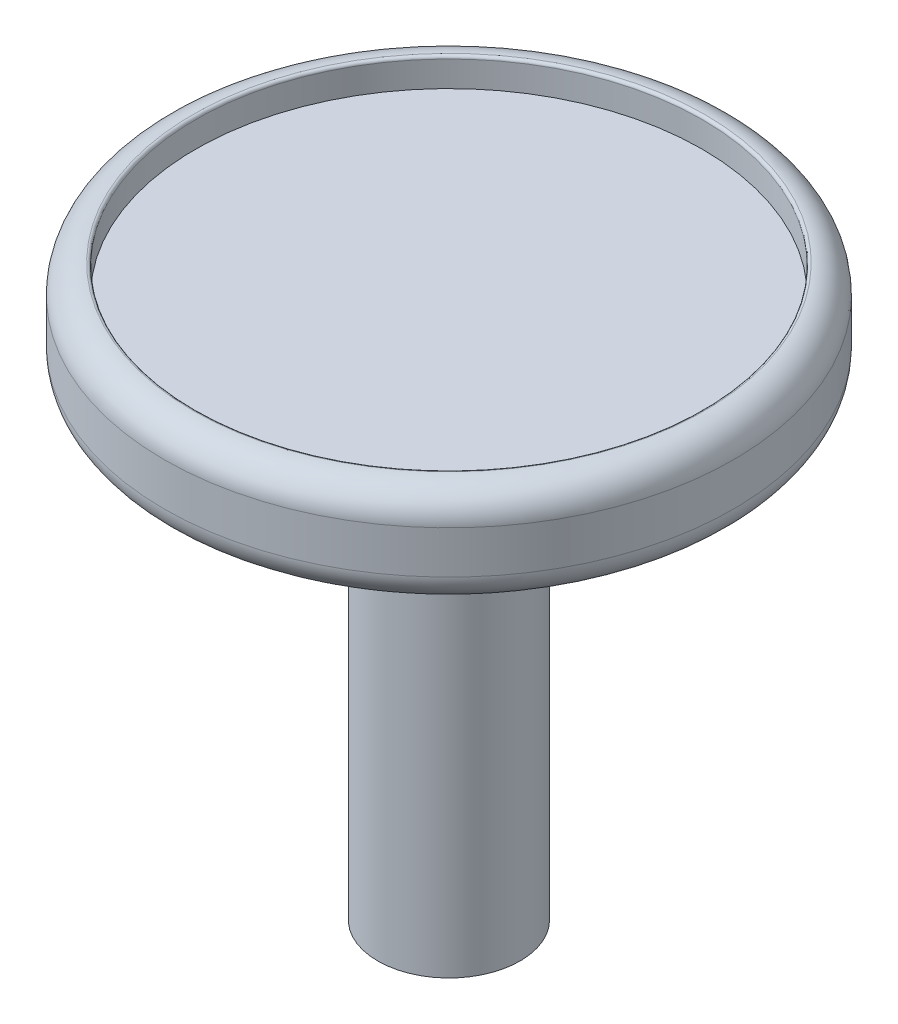
ISO-10303-21;
HEADER;
FILE_DESCRIPTION(('STEP AP214'),'2;1');
FILE_NAME('part.step','',(''),(''),'','','');
FILE_SCHEMA(('AUTOMOTIVE_DESIGN { 1 0 10303 214 1 1 1 1 }'));
ENDSEC;
DATA;
#1=APPLICATION_CONTEXT('core data for automotive mechanical design processes');
#2=APPLICATION_PROTOCOL_DEFINITION('international standard','automotive_design',2000,#1);
#3=PRODUCT_CONTEXT('',#1,'mechanical');
#4=PRODUCT('Part','Part','',(#3));
#5=PRODUCT_RELATED_PRODUCT_CATEGORY('part','',(#4));
#6=PRODUCT_DEFINITION_FORMATION('','',#4);
#7=PRODUCT_DEFINITION_CONTEXT('part definition',#1,'design');
#8=PRODUCT_DEFINITION('design','',#6,#7);
#9=PRODUCT_DEFINITION_SHAPE('','',#8);
#10=(LENGTH_UNIT() NAMED_UNIT(*) SI_UNIT(.MILLI.,.METRE.));
#11=(NAMED_UNIT(*) PLANE_ANGLE_UNIT() SI_UNIT($,.RADIAN.));
#12=(NAMED_UNIT(*) SI_UNIT($,.STERADIAN.) SOLID_ANGLE_UNIT());
#13=UNCERTAINTY_MEASURE_WITH_UNIT(LENGTH_MEASURE(1.E-05),#10,'distance_accuracy_value','');
#14=(GEOMETRIC_REPRESENTATION_CONTEXT(3) GLOBAL_UNCERTAINTY_ASSIGNED_CONTEXT((#13)) GLOBAL_UNIT_ASSIGNED_CONTEXT((#10,
#11,#12)) REPRESENTATION_CONTEXT('',''));
#15=CARTESIAN_POINT('',(0.,0.,0.));
#16=DIRECTION('',(0.,0.,1.));
#17=DIRECTION('',(1.,0.,0.));
#18=AXIS2_PLACEMENT_3D('',#15,#16,#17);
#19=CARTESIAN_POINT('',(0.,10.,0.));
#20=DIRECTION('',(0.,-1.,0.));
#21=DIRECTION('',(0.,0.,-1.));
#22=AXIS2_PLACEMENT_3D('',#19,#20,#21);
#23=CYLINDRICAL_SURFACE('',#22,2.5);
#24=CARTESIAN_POINT('',(0.,-10.,0.));
#25=DIRECTION('',(0.,1.,0.));
#26=DIRECTION('',(0.,0.,1.));
#27=AXIS2_PLACEMENT_3D('',#24,#25,#26);
#28=CIRCLE('',#27,2.5);
#29=CARTESIAN_POINT('',(0.,-10.,2.5));
#30=VERTEX_POINT('',#29);
#31=EDGE_CURVE('E99',#30,#30,#28,.T.);
#32=ORIENTED_EDGE('',*,*,#31,.T.);
#33=EDGE_LOOP('',(#32));
#34=FACE_BOUND('',#33,.T.);
#35=CARTESIAN_POINT('',(0.,6.5,0.));
#36=DIRECTION('',(0.,1.,0.));
#37=DIRECTION('',(0.,0.,1.));
#38=AXIS2_PLACEMENT_3D('',#35,#36,#37);
#39=CIRCLE('',#38,2.5);
#40=CARTESIAN_POINT('',(0.,6.5,2.5));
#41=VERTEX_POINT('',#40);
#42=EDGE_CURVE('E103',#41,#41,#39,.T.);
#43=ORIENTED_EDGE('',*,*,#42,.F.);
#44=EDGE_LOOP('',(#43));
#45=FACE_BOUND('',#44,.T.);
#46=ADVANCED_FACE('F41',(#34,#45),#23,.T.);
#47=CARTESIAN_POINT('',(1.025,10.,-0.65));
#48=DIRECTION('',(-1.,0.,0.));
#49=DIRECTION('',(0.,0.,1.));
#50=AXIS2_PLACEMENT_3D('',#47,#48,#49);
#51=PLANE('',#50);
#52=DIRECTION('',(0.,-1.,0.));
#53=VECTOR('',#52,1.);
#54=CARTESIAN_POINT('',(1.025,10.,0.65));
#55=LINE('',#54,#53);
#56=CARTESIAN_POINT('',(1.025,-6.,0.65));
#57=VERTEX_POINT('',#56);
#58=CARTESIAN_POINT('',(1.025,-10.,0.65));
#59=VERTEX_POINT('',#58);
#60=EDGE_CURVE('E63',#57,#59,#55,.T.);
#61=ORIENTED_EDGE('',*,*,#60,.F.);
#62=DIRECTION('',(0.,0.,-1.));
#63=VECTOR('',#62,1.);
#64=CARTESIAN_POINT('',(1.025,-6.,0.65));
#65=LINE('',#64,#63);
#66=CARTESIAN_POINT('',(1.025,-6.,-0.65));
#67=VERTEX_POINT('',#66);
#68=EDGE_CURVE('E56',#57,#67,#65,.T.);
#69=ORIENTED_EDGE('',*,*,#68,.T.);
#70=DIRECTION('',(0.,-1.,0.));
#71=VECTOR('',#70,1.);
#72=CARTESIAN_POINT('',(1.025,10.,-0.65));
#73=LINE('',#72,#71);
#74=CARTESIAN_POINT('',(1.025,-10.,-0.65));
#75=VERTEX_POINT('',#74);
#76=EDGE_CURVE('E91',#67,#75,#73,.T.);
#77=ORIENTED_EDGE('',*,*,#76,.T.);
#78=DIRECTION('',(0.,0.,-1.));
#79=VECTOR('',#78,1.);
#80=CARTESIAN_POINT('',(1.025,-10.,-0.65));
#81=LINE('',#80,#79);
#82=EDGE_CURVE('E148',#59,#75,#81,.T.);
#83=ORIENTED_EDGE('',*,*,#82,.F.);
#84=EDGE_LOOP('',(#61,#69,#77,#83));
#85=FACE_BOUND('',#84,.T.);
#86=ADVANCED_FACE('F90',(#85),#51,.T.);
#87=CARTESIAN_POINT('',(-1.025,10.,-0.65));
#88=DIRECTION('',(0.,0.,1.));
#89=DIRECTION('',(1.,0.,0.));
#90=AXIS2_PLACEMENT_3D('',#87,#88,#89);
#91=PLANE('',#90);
#92=ORIENTED_EDGE('',*,*,#76,.F.);
#93=DIRECTION('',(-1.,0.,0.));
#94=VECTOR('',#93,1.);
#95=CARTESIAN_POINT('',(1.025,-6.,-0.65));
#96=LINE('',#95,#94);
#97=CARTESIAN_POINT('',(-1.025,-6.,-0.65));
#98=VERTEX_POINT('',#97);
#99=EDGE_CURVE('E81',#67,#98,#96,.T.);
#100=ORIENTED_EDGE('',*,*,#99,.T.);
#101=DIRECTION('',(0.,-1.,0.));
#102=VECTOR('',#101,1.);
#103=CARTESIAN_POINT('',(-1.025,10.,-0.65));
#104=LINE('',#103,#102);
#105=CARTESIAN_POINT('',(-1.025,-10.,-0.65));
#106=VERTEX_POINT('',#105);
#107=EDGE_CURVE('E100',#98,#106,#104,.T.);
#108=ORIENTED_EDGE('',*,*,#107,.T.);
#109=DIRECTION('',(-1.,0.,0.));
#110=VECTOR('',#109,1.);
#111=CARTESIAN_POINT('',(-1.025,-10.,-0.65));
#112=LINE('',#111,#110);
#113=EDGE_CURVE('E97',#75,#106,#112,.T.);
#114=ORIENTED_EDGE('',*,*,#113,.F.);
#115=EDGE_LOOP('',(#92,#100,#108,#114));
#116=FACE_BOUND('',#115,.T.);
#117=ADVANCED_FACE('F95',(#116),#91,.T.);
#118=CARTESIAN_POINT('',(-1.025,10.,-0.65));
#119=DIRECTION('',(1.,0.,0.));
#120=DIRECTION('',(0.,0.,-1.));
#121=AXIS2_PLACEMENT_3D('',#118,#119,#120);
#122=PLANE('',#121);
#123=ORIENTED_EDGE('',*,*,#107,.F.);
#124=DIRECTION('',(0.,0.,1.));
#125=VECTOR('',#124,1.);
#126=CARTESIAN_POINT('',(-1.025,-6.,-0.65));
#127=LINE('',#126,#125);
#128=CARTESIAN_POINT('',(-1.025,-6.,0.65));
#129=VERTEX_POINT('',#128);
#130=EDGE_CURVE('E84',#98,#129,#127,.T.);
#131=ORIENTED_EDGE('',*,*,#130,.T.);
#132=DIRECTION('',(0.,-1.,0.));
#133=VECTOR('',#132,1.);
#134=CARTESIAN_POINT('',(-1.025,10.,0.65));
#135=LINE('',#134,#133);
#136=CARTESIAN_POINT('',(-1.025,-10.,0.65));
#137=VERTEX_POINT('',#136);
#138=EDGE_CURVE('E105',#129,#137,#135,.T.);
#139=ORIENTED_EDGE('',*,*,#138,.T.);
#140=DIRECTION('',(0.,0.,1.));
#141=VECTOR('',#140,1.);
#142=CARTESIAN_POINT('',(-1.025,-10.,-0.65));
#143=LINE('',#142,#141);
#144=EDGE_CURVE('E151',#106,#137,#143,.T.);
#145=ORIENTED_EDGE('',*,*,#144,.F.);
#146=EDGE_LOOP('',(#123,#131,#139,#145));
#147=FACE_BOUND('',#146,.T.);
#148=ADVANCED_FACE('F160',(#147),#122,.T.);
#149=CARTESIAN_POINT('',(-1.025,10.,0.65));
#150=DIRECTION('',(0.,0.,-1.));
#151=DIRECTION('',(-1.,0.,0.));
#152=AXIS2_PLACEMENT_3D('',#149,#150,#151);
#153=PLANE('',#152);
#154=ORIENTED_EDGE('',*,*,#138,.F.);
#155=DIRECTION('',(1.,0.,0.));
#156=VECTOR('',#155,1.);
#157=CARTESIAN_POINT('',(-1.025,-6.,0.65));
#158=LINE('',#157,#156);
#159=EDGE_CURVE('E93',#129,#57,#158,.T.);
#160=ORIENTED_EDGE('',*,*,#159,.T.);
#161=ORIENTED_EDGE('',*,*,#60,.T.);
#162=DIRECTION('',(1.,0.,0.));
#163=VECTOR('',#162,1.);
#164=CARTESIAN_POINT('',(-1.025,-10.,0.65));
#165=LINE('',#164,#163);
#166=EDGE_CURVE('E154',#137,#59,#165,.T.);
#167=ORIENTED_EDGE('',*,*,#166,.F.);
#168=EDGE_LOOP('',(#154,#160,#161,#167));
#169=FACE_BOUND('',#168,.T.);
#170=ADVANCED_FACE('F161',(#169),#153,.T.);
#171=CARTESIAN_POINT('',(0.,-10.,0.));
#172=DIRECTION('',(0.,1.,0.));
#173=DIRECTION('',(0.,0.,1.));
#174=AXIS2_PLACEMENT_3D('',#171,#172,#173);
#175=PLANE('',#174);
#176=ORIENTED_EDGE('',*,*,#31,.F.);
#177=EDGE_LOOP('',(#176));
#178=FACE_BOUND('',#177,.T.);
#179=ORIENTED_EDGE('',*,*,#82,.T.);
#180=ORIENTED_EDGE('',*,*,#113,.T.);
#181=ORIENTED_EDGE('',*,*,#144,.T.);
#182=ORIENTED_EDGE('',*,*,#166,.T.);
#183=EDGE_LOOP('',(#179,#180,#181,#182));
#184=FACE_BOUND('',#183,.T.);
#185=ADVANCED_FACE('F163',(#178,#184),#175,.F.);
#186=CARTESIAN_POINT('',(0.,-6.,0.));
#187=DIRECTION('',(0.,1.,0.));
#188=DIRECTION('',(0.,0.,1.));
#189=AXIS2_PLACEMENT_3D('',#186,#187,#188);
#190=PLANE('',#189);
#191=ORIENTED_EDGE('',*,*,#159,.F.);
#192=ORIENTED_EDGE('',*,*,#130,.F.);
#193=ORIENTED_EDGE('',*,*,#99,.F.);
#194=ORIENTED_EDGE('',*,*,#68,.F.);
#195=EDGE_LOOP('',(#191,#192,#193,#194));
#196=FACE_BOUND('',#195,.T.);
#197=ADVANCED_FACE('F82',(#196),#190,.F.);
#198=CARTESIAN_POINT('',(0.,6.5,0.));
#199=DIRECTION('',(0.,1.,0.));
#200=DIRECTION('',(0.,0.,1.));
#201=AXIS2_PLACEMENT_3D('',#198,#199,#200);
#202=CYLINDRICAL_SURFACE('',#201,10.);
#203=CARTESIAN_POINT('',(0.,9.,0.));
#204=DIRECTION('',(0.,1.,0.));
#205=DIRECTION('',(0.,0.,1.));
#206=AXIS2_PLACEMENT_3D('',#203,#204,#205);
#207=CIRCLE('',#206,10.);
#208=CARTESIAN_POINT('',(0.,9.,10.));
#209=VERTEX_POINT('',#208);
#210=EDGE_CURVE('E49',#209,#209,#207,.F.);
#211=ORIENTED_EDGE('',*,*,#210,.T.);
#212=EDGE_LOOP('',(#211));
#213=FACE_BOUND('',#212,.T.);
#214=CARTESIAN_POINT('',(0.,7.5,0.));
#215=DIRECTION('',(0.,1.,0.));
#216=DIRECTION('',(0.,0.,1.));
#217=AXIS2_PLACEMENT_3D('',#214,#215,#216);
#218=CIRCLE('',#217,10.);
#219=CARTESIAN_POINT('',(0.,7.5,10.));
#220=VERTEX_POINT('',#219);
#221=EDGE_CURVE('E111',#220,#220,#218,.T.);
#222=ORIENTED_EDGE('',*,*,#221,.T.);
#223=EDGE_LOOP('',(#222));
#224=FACE_BOUND('',#223,.T.);
#225=ADVANCED_FACE('F122',(#213,#224),#202,.T.);
#226=CARTESIAN_POINT('',(0.,6.5,0.));
#227=DIRECTION('',(0.,1.,0.));
#228=DIRECTION('',(0.,0.,1.));
#229=AXIS2_PLACEMENT_3D('',#226,#227,#228);
#230=PLANE('',#229);
#231=CARTESIAN_POINT('',(0.,6.5,0.));
#232=DIRECTION('',(0.,1.,0.));
#233=DIRECTION('',(0.,0.,1.));
#234=AXIS2_PLACEMENT_3D('',#231,#232,#233);
#235=CIRCLE('',#234,9.);
#236=CARTESIAN_POINT('',(0.,6.5,9.));
#237=VERTEX_POINT('',#236);
#238=EDGE_CURVE('E114',#237,#237,#235,.F.);
#239=ORIENTED_EDGE('',*,*,#238,.T.);
#240=EDGE_LOOP('',(#239));
#241=FACE_BOUND('',#240,.T.);
#242=ORIENTED_EDGE('',*,*,#42,.T.);
#243=EDGE_LOOP('',(#242));
#244=FACE_BOUND('',#243,.T.);
#245=ADVANCED_FACE('F185',(#241,#244),#230,.F.);
#246=CARTESIAN_POINT('',(0.,7.5,0.));
#247=DIRECTION('',(0.,1.,0.));
#248=DIRECTION('',(0.,0.,1.));
#249=AXIS2_PLACEMENT_3D('',#246,#247,#248);
#250=TOROIDAL_SURFACE('',#249,9.,1.);
#251=ORIENTED_EDGE('',*,*,#238,.F.);
#252=EDGE_LOOP('',(#251));
#253=FACE_BOUND('',#252,.T.);
#254=ORIENTED_EDGE('',*,*,#221,.F.);
#255=EDGE_LOOP('',(#254));
#256=FACE_BOUND('',#255,.T.);
#257=ADVANCED_FACE('F129',(#253,#256),#250,.T.);
#258=CARTESIAN_POINT('',(0.,9.,0.));
#259=DIRECTION('',(0.,1.,0.));
#260=DIRECTION('',(0.,0.,1.));
#261=AXIS2_PLACEMENT_3D('',#258,#259,#260);
#262=TOROIDAL_SURFACE('',#261,9.,1.);
#263=ORIENTED_EDGE('',*,*,#210,.F.);
#264=EDGE_LOOP('',(#263));
#265=FACE_BOUND('',#264,.T.);
#266=CARTESIAN_POINT('',(0.,10.,0.));
#267=DIRECTION('',(0.,1.,0.));
#268=DIRECTION('',(0.,0.,1.));
#269=AXIS2_PLACEMENT_3D('',#266,#267,#268);
#270=CIRCLE('',#269,9.);
#271=CARTESIAN_POINT('',(0.,10.,9.));
#272=VERTEX_POINT('',#271);
#273=EDGE_CURVE('E117',#272,#272,#270,.T.);
#274=ORIENTED_EDGE('',*,*,#273,.F.);
#275=EDGE_LOOP('',(#274));
#276=FACE_BOUND('',#275,.T.);
#277=ADVANCED_FACE('F125',(#265,#276),#262,.T.);
#278=CARTESIAN_POINT('',(0.,9.,0.));
#279=DIRECTION('',(0.,1.,0.));
#280=DIRECTION('',(0.,0.,1.));
#281=AXIS2_PLACEMENT_3D('',#278,#279,#280);
#282=CYLINDRICAL_SURFACE('',#281,8.9);
#283=CARTESIAN_POINT('',(0.,9.9,0.));
#284=DIRECTION('',(0.,1.,0.));
#285=DIRECTION('',(0.,0.,1.));
#286=AXIS2_PLACEMENT_3D('',#283,#284,#285);
#287=CIRCLE('',#286,8.9);
#288=CARTESIAN_POINT('',(0.,9.9,8.9));
#289=VERTEX_POINT('',#288);
#290=EDGE_CURVE('E11',#289,#289,#287,.T.);
#291=ORIENTED_EDGE('',*,*,#290,.T.);
#292=EDGE_LOOP('',(#291));
#293=FACE_BOUND('',#292,.T.);
#294=CARTESIAN_POINT('',(0.,9.,0.));
#295=DIRECTION('',(0.,1.,0.));
#296=DIRECTION('',(0.,0.,1.));
#297=AXIS2_PLACEMENT_3D('',#294,#295,#296);
#298=CIRCLE('',#297,8.9);
#299=CARTESIAN_POINT('',(0.,9.,8.9));
#300=VERTEX_POINT('',#299);
#301=EDGE_CURVE('E142',#300,#300,#298,.T.);
#302=ORIENTED_EDGE('',*,*,#301,.F.);
#303=EDGE_LOOP('',(#302));
#304=FACE_BOUND('',#303,.T.);
#305=ADVANCED_FACE('F128',(#293,#304),#282,.F.);
#306=CARTESIAN_POINT('',(0.,9.,0.));
#307=DIRECTION('',(0.,1.,0.));
#308=DIRECTION('',(0.,0.,1.));
#309=AXIS2_PLACEMENT_3D('',#306,#307,#308);
#310=PLANE('',#309);
#311=ORIENTED_EDGE('',*,*,#301,.T.);
#312=EDGE_LOOP('',(#311));
#313=FACE_BOUND('',#312,.T.);
#314=ADVANCED_FACE('F134',(#313),#310,.T.);
#315=CARTESIAN_POINT('',(0.,9.9,0.));
#316=DIRECTION('',(0.,1.,0.));
#317=DIRECTION('',(0.,0.,1.));
#318=AXIS2_PLACEMENT_3D('',#315,#316,#317);
#319=TOROIDAL_SURFACE('',#318,9.,0.1);
#320=ORIENTED_EDGE('',*,*,#273,.T.);
#321=EDGE_LOOP('',(#320));
#322=FACE_BOUND('',#321,.T.);
#323=ORIENTED_EDGE('',*,*,#290,.F.);
#324=EDGE_LOOP('',(#323));
#325=FACE_BOUND('',#324,.T.);
#326=ADVANCED_FACE('F43',(#322,#325),#319,.T.);
#327=CLOSED_SHELL('',(#46,#86,#117,#148,#170,#185,#197,#225,#245,#257,#277,#305,#314,#326));
#328=MANIFOLD_SOLID_BREP('B2',#327);
#329=ADVANCED_BREP_SHAPE_REPRESENTATION('',(#18,#328),#14);
#330=SHAPE_DEFINITION_REPRESENTATION(#9,#329);
ENDSEC;
END-ISO-10303-21;
